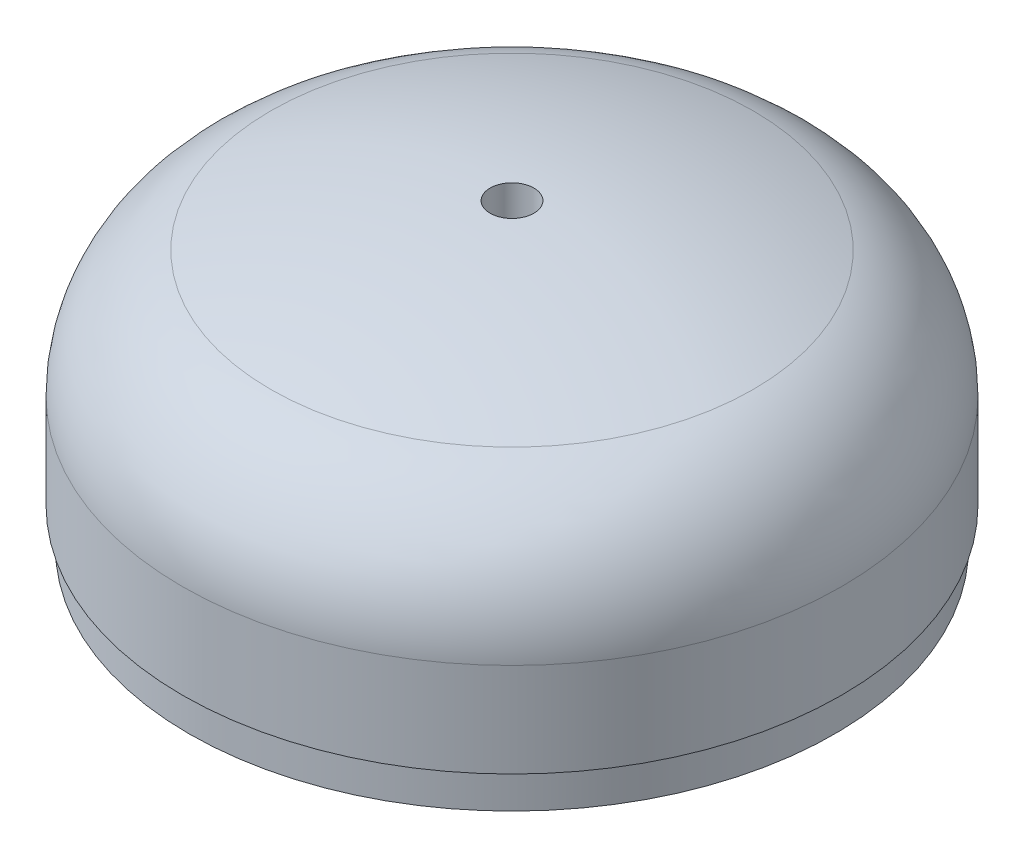
ISO-10303-21;
HEADER;
FILE_DESCRIPTION(('STEP AP214'),'2;1');
FILE_NAME('part.step','',(''),(''),'','','');
FILE_SCHEMA(('AUTOMOTIVE_DESIGN { 1 0 10303 214 1 1 1 1 }'));
ENDSEC;
DATA;
#1=APPLICATION_CONTEXT('core data for automotive mechanical design processes');
#2=APPLICATION_PROTOCOL_DEFINITION('international standard','automotive_design',2000,#1);
#3=PRODUCT_CONTEXT('',#1,'mechanical');
#4=PRODUCT('Part','Part','',(#3));
#5=PRODUCT_RELATED_PRODUCT_CATEGORY('part','',(#4));
#6=PRODUCT_DEFINITION_FORMATION('','',#4);
#7=PRODUCT_DEFINITION_CONTEXT('part definition',#1,'design');
#8=PRODUCT_DEFINITION('design','',#6,#7);
#9=PRODUCT_DEFINITION_SHAPE('','',#8);
#10=(LENGTH_UNIT() NAMED_UNIT(*) SI_UNIT(.MILLI.,.METRE.));
#11=(NAMED_UNIT(*) PLANE_ANGLE_UNIT() SI_UNIT($,.RADIAN.));
#12=(NAMED_UNIT(*) SI_UNIT($,.STERADIAN.) SOLID_ANGLE_UNIT());
#13=UNCERTAINTY_MEASURE_WITH_UNIT(LENGTH_MEASURE(1.E-05),#10,'distance_accuracy_value','');
#14=(GEOMETRIC_REPRESENTATION_CONTEXT(3) GLOBAL_UNCERTAINTY_ASSIGNED_CONTEXT((#13)) GLOBAL_UNIT_ASSIGNED_CONTEXT((#10,
#11,#12)) REPRESENTATION_CONTEXT('',''));
#15=CARTESIAN_POINT('',(0.,0.,0.));
#16=DIRECTION('',(0.,0.,1.));
#17=DIRECTION('',(1.,0.,0.));
#18=AXIS2_PLACEMENT_3D('',#15,#16,#17);
#19=CARTESIAN_POINT('',(0.,-76.0306146111119,0.));
#20=DIRECTION('',(0.,1.,0.));
#21=DIRECTION('',(-1.,0.,0.));
#22=AXIS2_PLACEMENT_3D('',#19,#20,#21);
#23=SPHERICAL_SURFACE('',#22,133.985);
#24=CARTESIAN_POINT('',(0.,57.8880256001746,0.));
#25=DIRECTION('',(0.,1.,0.));
#26=DIRECTION('',(0.,0.,1.));
#27=AXIS2_PLACEMENT_3D('',#24,#25,#26);
#28=CIRCLE('',#27,4.21640000000002);
#29=CARTESIAN_POINT('',(0.,57.8880256001746,4.21640000000002));
#30=VERTEX_POINT('',#29);
#31=EDGE_CURVE('E78',#30,#30,#28,.T.);
#32=ORIENTED_EDGE('',*,*,#31,.F.);
#33=EDGE_LOOP('',(#32));
#34=FACE_BOUND('',#33,.T.);
#35=CARTESIAN_POINT('',(0.,49.6263283438147,0.));
#36=DIRECTION('',(0.,1.,0.));
#37=DIRECTION('',(0.,0.,1.));
#38=AXIS2_PLACEMENT_3D('',#35,#36,#37);
#39=CIRCLE('',#38,46.5006764705882);
#40=CARTESIAN_POINT('',(0.,49.6263283438147,46.5006764705882));
#41=VERTEX_POINT('',#40);
#42=EDGE_CURVE('E11',#41,#41,#39,.T.);
#43=ORIENTED_EDGE('',*,*,#42,.T.);
#44=EDGE_LOOP('',(#43));
#45=FACE_BOUND('',#44,.T.);
#46=ADVANCED_FACE('F40',(#34,#45),#23,.T.);
#47=CARTESIAN_POINT('',(0.,25.2095763952271,0.));
#48=DIRECTION('',(0.,1.,0.));
#49=DIRECTION('',(0.,0.,1.));
#50=AXIS2_PLACEMENT_3D('',#47,#48,#49);
#51=TOROIDAL_SURFACE('',#50,37.465,26.035);
#52=CARTESIAN_POINT('',(0.,25.2095763952271,0.));
#53=DIRECTION('',(0.,1.,0.));
#54=DIRECTION('',(0.,0.,1.));
#55=AXIS2_PLACEMENT_3D('',#52,#53,#54);
#56=CIRCLE('',#55,63.4999999999999);
#57=CARTESIAN_POINT('',(0.,25.2095763952271,63.4999999999999));
#58=VERTEX_POINT('',#57);
#59=EDGE_CURVE('E45',#58,#58,#56,.T.);
#60=ORIENTED_EDGE('',*,*,#59,.T.);
#61=EDGE_LOOP('',(#60));
#62=FACE_BOUND('',#61,.T.);
#63=ORIENTED_EDGE('',*,*,#42,.F.);
#64=EDGE_LOOP('',(#63));
#65=FACE_BOUND('',#64,.T.);
#66=ADVANCED_FACE('F85',(#62,#65),#51,.T.);
#67=CARTESIAN_POINT('',(0.,127.060987048289,0.));
#68=DIRECTION('',(0.,1.,0.));
#69=DIRECTION('',(0.,0.,1.));
#70=AXIS2_PLACEMENT_3D('',#67,#68,#69);
#71=CYLINDRICAL_SURFACE('',#70,63.4999999999999);
#72=ORIENTED_EDGE('',*,*,#59,.F.);
#73=EDGE_LOOP('',(#72));
#74=FACE_BOUND('',#73,.T.);
#75=CARTESIAN_POINT('',(0.,7.08802560017459,0.));
#76=DIRECTION('',(0.,1.,0.));
#77=DIRECTION('',(0.,0.,1.));
#78=AXIS2_PLACEMENT_3D('',#75,#76,#77);
#79=CIRCLE('',#78,63.4999999999999);
#80=CARTESIAN_POINT('',(0.,7.08802560017459,63.4999999999999));
#81=VERTEX_POINT('',#80);
#82=EDGE_CURVE('E50',#81,#81,#79,.T.);
#83=ORIENTED_EDGE('',*,*,#82,.T.);
#84=EDGE_LOOP('',(#83));
#85=FACE_BOUND('',#84,.T.);
#86=ADVANCED_FACE('F89',(#74,#85),#71,.T.);
#87=CARTESIAN_POINT('',(0.,6.34999999999999,0.));
#88=DIRECTION('',(0.,1.,0.));
#89=DIRECTION('',(0.,0.,1.));
#90=AXIS2_PLACEMENT_3D('',#87,#88,#89);
#91=CONICAL_SURFACE('',#90,62.2217021632111,1.04719755119659);
#92=ORIENTED_EDGE('',*,*,#82,.F.);
#93=EDGE_LOOP('',(#92));
#94=FACE_BOUND('',#93,.T.);
#95=CARTESIAN_POINT('',(0.,6.34999999999999,0.));
#96=DIRECTION('',(0.,1.,0.));
#97=DIRECTION('',(0.,0.,1.));
#98=AXIS2_PLACEMENT_3D('',#95,#96,#97);
#99=CIRCLE('',#98,62.2217021632111);
#100=CARTESIAN_POINT('',(0.,6.34999999999999,62.2217021632111));
#101=VERTEX_POINT('',#100);
#102=EDGE_CURVE('E54',#101,#101,#99,.T.);
#103=ORIENTED_EDGE('',*,*,#102,.T.);
#104=EDGE_LOOP('',(#103));
#105=FACE_BOUND('',#104,.T.);
#106=ADVANCED_FACE('F93',(#94,#105),#91,.T.);
#107=CARTESIAN_POINT('',(0.,127.060987048289,0.));
#108=DIRECTION('',(0.,1.,0.));
#109=DIRECTION('',(0.,0.,1.));
#110=AXIS2_PLACEMENT_3D('',#107,#108,#109);
#111=CYLINDRICAL_SURFACE('',#110,62.2217021632111);
#112=CARTESIAN_POINT('',(0.,0.,0.));
#113=DIRECTION('',(0.,1.,0.));
#114=DIRECTION('',(0.,0.,1.));
#115=AXIS2_PLACEMENT_3D('',#112,#113,#114);
#116=CIRCLE('',#115,62.2217021632111);
#117=CARTESIAN_POINT('',(0.,0.,62.2217021632111));
#118=VERTEX_POINT('',#117);
#119=EDGE_CURVE('E60',#118,#118,#116,.T.);
#120=ORIENTED_EDGE('',*,*,#119,.T.);
#121=EDGE_LOOP('',(#120));
#122=FACE_BOUND('',#121,.T.);
#123=ORIENTED_EDGE('',*,*,#102,.F.);
#124=EDGE_LOOP('',(#123));
#125=FACE_BOUND('',#124,.T.);
#126=ADVANCED_FACE('F100',(#122,#125),#111,.T.);
#127=CARTESIAN_POINT('',(0.,0.,0.));
#128=DIRECTION('',(0.,-1.,0.));
#129=DIRECTION('',(0.,0.,-1.));
#130=AXIS2_PLACEMENT_3D('',#127,#128,#129);
#131=PLANE('',#130);
#132=CARTESIAN_POINT('',(0.,0.,0.));
#133=DIRECTION('',(0.,1.,0.));
#134=DIRECTION('',(0.,0.,1.));
#135=AXIS2_PLACEMENT_3D('',#132,#133,#134);
#136=CIRCLE('',#135,59.8404521632111);
#137=CARTESIAN_POINT('',(0.,0.,59.8404521632111));
#138=VERTEX_POINT('',#137);
#139=EDGE_CURVE('E63',#138,#138,#136,.T.);
#140=ORIENTED_EDGE('',*,*,#139,.T.);
#141=EDGE_LOOP('',(#140));
#142=FACE_BOUND('',#141,.T.);
#143=ORIENTED_EDGE('',*,*,#119,.F.);
#144=EDGE_LOOP('',(#143));
#145=FACE_BOUND('',#144,.T.);
#146=ADVANCED_FACE('F104',(#142,#145),#131,.T.);
#147=CARTESIAN_POINT('',(0.,127.060987048289,0.));
#148=DIRECTION('',(0.,1.,0.));
#149=DIRECTION('',(0.,0.,1.));
#150=AXIS2_PLACEMENT_3D('',#147,#148,#149);
#151=CYLINDRICAL_SURFACE('',#150,59.8404521632111);
#152=CARTESIAN_POINT('',(0.,6.34999999999999,0.));
#153=DIRECTION('',(0.,1.,0.));
#154=DIRECTION('',(0.,0.,1.));
#155=AXIS2_PLACEMENT_3D('',#152,#153,#154);
#156=CIRCLE('',#155,59.8404521632111);
#157=CARTESIAN_POINT('',(0.,6.34999999999999,59.8404521632111));
#158=VERTEX_POINT('',#157);
#159=EDGE_CURVE('E66',#158,#158,#156,.T.);
#160=ORIENTED_EDGE('',*,*,#159,.T.);
#161=EDGE_LOOP('',(#160));
#162=FACE_BOUND('',#161,.T.);
#163=ORIENTED_EDGE('',*,*,#139,.F.);
#164=EDGE_LOOP('',(#163));
#165=FACE_BOUND('',#164,.T.);
#166=ADVANCED_FACE('F108',(#162,#165),#151,.F.);
#167=CARTESIAN_POINT('',(0.,6.34999999999999,0.));
#168=DIRECTION('',(0.,-1.,0.));
#169=DIRECTION('',(0.,0.,-1.));
#170=AXIS2_PLACEMENT_3D('',#167,#168,#169);
#171=CONICAL_SURFACE('',#170,59.8404521632111,0.174532925199436);
#172=CARTESIAN_POINT('',(0.,25.2095763952271,0.));
#173=DIRECTION('',(0.,1.,0.));
#174=DIRECTION('',(0.,0.,1.));
#175=AXIS2_PLACEMENT_3D('',#172,#173,#174);
#176=CIRCLE('',#175,56.515);
#177=CARTESIAN_POINT('',(0.,25.2095763952271,56.515));
#178=VERTEX_POINT('',#177);
#179=EDGE_CURVE('E69',#178,#178,#176,.T.);
#180=ORIENTED_EDGE('',*,*,#179,.T.);
#181=EDGE_LOOP('',(#180));
#182=FACE_BOUND('',#181,.T.);
#183=ORIENTED_EDGE('',*,*,#159,.F.);
#184=EDGE_LOOP('',(#183));
#185=FACE_BOUND('',#184,.T.);
#186=ADVANCED_FACE('F112',(#182,#185),#171,.F.);
#187=CARTESIAN_POINT('',(0.,25.2095763952271,0.));
#188=DIRECTION('',(0.,1.,0.));
#189=DIRECTION('',(0.,0.,1.));
#190=AXIS2_PLACEMENT_3D('',#187,#188,#189);
#191=TOROIDAL_SURFACE('',#190,37.465,19.05);
#192=CARTESIAN_POINT('',(0.,43.0754924551693,0.));
#193=DIRECTION('',(0.,1.,0.));
#194=DIRECTION('',(0.,0.,1.));
#195=AXIS2_PLACEMENT_3D('',#192,#193,#194);
#196=CIRCLE('',#195,44.0764705882353);
#197=CARTESIAN_POINT('',(0.,43.0754924551693,44.0764705882353));
#198=VERTEX_POINT('',#197);
#199=EDGE_CURVE('E72',#198,#198,#196,.T.);
#200=ORIENTED_EDGE('',*,*,#199,.T.);
#201=EDGE_LOOP('',(#200));
#202=FACE_BOUND('',#201,.T.);
#203=ORIENTED_EDGE('',*,*,#179,.F.);
#204=EDGE_LOOP('',(#203));
#205=FACE_BOUND('',#204,.T.);
#206=ADVANCED_FACE('F116',(#202,#205),#191,.F.);
#207=CARTESIAN_POINT('',(0.,-76.0306146111119,0.));
#208=DIRECTION('',(0.,1.,0.));
#209=DIRECTION('',(-1.,0.,0.));
#210=AXIS2_PLACEMENT_3D('',#207,#208,#209);
#211=SPHERICAL_SURFACE('',#210,127.);
#212=CARTESIAN_POINT('',(0.,50.8993738511896,0.));
#213=DIRECTION('',(0.,1.,0.));
#214=DIRECTION('',(0.,0.,1.));
#215=AXIS2_PLACEMENT_3D('',#212,#213,#214);
#216=CIRCLE('',#215,4.21640000000002);
#217=CARTESIAN_POINT('',(0.,50.8993738511896,4.21640000000002));
#218=VERTEX_POINT('',#217);
#219=EDGE_CURVE('E75',#218,#218,#216,.T.);
#220=ORIENTED_EDGE('',*,*,#219,.T.);
#221=EDGE_LOOP('',(#220));
#222=FACE_BOUND('',#221,.T.);
#223=ORIENTED_EDGE('',*,*,#199,.F.);
#224=EDGE_LOOP('',(#223));
#225=FACE_BOUND('',#224,.T.);
#226=ADVANCED_FACE('F120',(#222,#225),#211,.F.);
#227=CARTESIAN_POINT('',(0.,127.060987048289,0.));
#228=DIRECTION('',(0.,1.,0.));
#229=DIRECTION('',(0.,0.,1.));
#230=AXIS2_PLACEMENT_3D('',#227,#228,#229);
#231=CYLINDRICAL_SURFACE('',#230,4.21640000000002);
#232=ORIENTED_EDGE('',*,*,#219,.F.);
#233=EDGE_LOOP('',(#232));
#234=FACE_BOUND('',#233,.T.);
#235=ORIENTED_EDGE('',*,*,#31,.T.);
#236=EDGE_LOOP('',(#235));
#237=FACE_BOUND('',#236,.T.);
#238=ADVANCED_FACE('F82',(#234,#237),#231,.F.);
#239=CLOSED_SHELL('',(#46,#66,#86,#106,#126,#146,#166,#186,#206,#226,#238));
#240=MANIFOLD_SOLID_BREP('B2',#239);
#241=ADVANCED_BREP_SHAPE_REPRESENTATION('',(#18,#240),#14);
#242=SHAPE_DEFINITION_REPRESENTATION(#9,#241);
ENDSEC;
END-ISO-10303-21;
